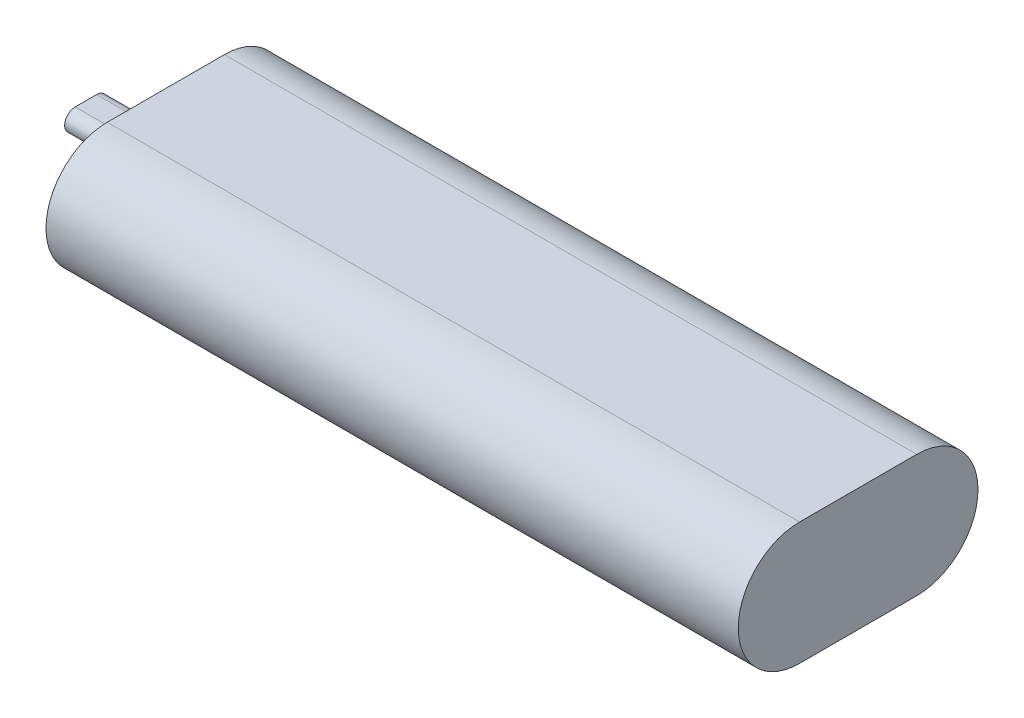
ISO-10303-21;
HEADER;
FILE_DESCRIPTION(('STEP AP214'),'2;1');
FILE_NAME('part.step','',(''),(''),'','','');
FILE_SCHEMA(('AUTOMOTIVE_DESIGN { 1 0 10303 214 1 1 1 1 }'));
ENDSEC;
DATA;
#1=APPLICATION_CONTEXT('core data for automotive mechanical design processes');
#2=APPLICATION_PROTOCOL_DEFINITION('international standard','automotive_design',2000,#1);
#3=PRODUCT_CONTEXT('',#1,'mechanical');
#4=PRODUCT('Part','Part','',(#3));
#5=PRODUCT_RELATED_PRODUCT_CATEGORY('part','',(#4));
#6=PRODUCT_DEFINITION_FORMATION('','',#4);
#7=PRODUCT_DEFINITION_CONTEXT('part definition',#1,'design');
#8=PRODUCT_DEFINITION('design','',#6,#7);
#9=PRODUCT_DEFINITION_SHAPE('','',#8);
#10=(LENGTH_UNIT() NAMED_UNIT(*) SI_UNIT(.MILLI.,.METRE.));
#11=(NAMED_UNIT(*) PLANE_ANGLE_UNIT() SI_UNIT($,.RADIAN.));
#12=(NAMED_UNIT(*) SI_UNIT($,.STERADIAN.) SOLID_ANGLE_UNIT());
#13=UNCERTAINTY_MEASURE_WITH_UNIT(LENGTH_MEASURE(1.E-05),#10,'distance_accuracy_value','');
#14=(GEOMETRIC_REPRESENTATION_CONTEXT(3) GLOBAL_UNCERTAINTY_ASSIGNED_CONTEXT((#13)) GLOBAL_UNIT_ASSIGNED_CONTEXT((#10,
#11,#12)) REPRESENTATION_CONTEXT('',''));
#15=CARTESIAN_POINT('',(0.,0.,0.));
#16=DIRECTION('',(0.,0.,1.));
#17=DIRECTION('',(1.,0.,0.));
#18=AXIS2_PLACEMENT_3D('',#15,#16,#17);
#19=CARTESIAN_POINT('',(-65.,0.,11.));
#20=DIRECTION('',(1.,0.,0.));
#21=DIRECTION('',(0.,0.,-1.));
#22=AXIS2_PLACEMENT_3D('',#19,#20,#21);
#23=PLANE('',#22);
#24=CARTESIAN_POINT('',(-65.,0.,11.));
#25=DIRECTION('',(1.,0.,0.));
#26=DIRECTION('',(0.,0.,-1.));
#27=AXIS2_PLACEMENT_3D('',#24,#25,#26);
#28=CIRCLE('',#27,11.5);
#29=CARTESIAN_POINT('',(-65.,11.5,11.));
#30=VERTEX_POINT('',#29);
#31=CARTESIAN_POINT('',(-65.,-11.5,11.));
#32=VERTEX_POINT('',#31);
#33=EDGE_CURVE('E137',#30,#32,#28,.T.);
#34=ORIENTED_EDGE('',*,*,#33,.F.);
#35=DIRECTION('',(0.,0.,1.));
#36=VECTOR('',#35,1.);
#37=CARTESIAN_POINT('',(-65.,11.5,11.));
#38=LINE('',#37,#36);
#39=CARTESIAN_POINT('',(-65.,11.5,-11.));
#40=VERTEX_POINT('',#39);
#41=EDGE_CURVE('E146',#40,#30,#38,.T.);
#42=ORIENTED_EDGE('',*,*,#41,.F.);
#43=CARTESIAN_POINT('',(-65.,0.,-11.));
#44=DIRECTION('',(1.,0.,0.));
#45=DIRECTION('',(0.,0.,-1.));
#46=AXIS2_PLACEMENT_3D('',#43,#44,#45);
#47=CIRCLE('',#46,11.5);
#48=CARTESIAN_POINT('',(-65.,-11.5,-11.));
#49=VERTEX_POINT('',#48);
#50=EDGE_CURVE('E143',#49,#40,#47,.T.);
#51=ORIENTED_EDGE('',*,*,#50,.F.);
#52=DIRECTION('',(0.,0.,-1.));
#53=VECTOR('',#52,1.);
#54=CARTESIAN_POINT('',(-65.,-11.5,11.));
#55=LINE('',#54,#53);
#56=EDGE_CURVE('E140',#32,#49,#55,.T.);
#57=ORIENTED_EDGE('',*,*,#56,.F.);
#58=EDGE_LOOP('',(#34,#42,#51,#57));
#59=FACE_BOUND('',#58,.T.);
#60=CARTESIAN_POINT('',(-65.,0.,-2.));
#61=DIRECTION('',(-1.,0.,0.));
#62=DIRECTION('',(0.,0.,1.));
#63=AXIS2_PLACEMENT_3D('',#60,#61,#62);
#64=CIRCLE('',#63,2.);
#65=CARTESIAN_POINT('',(-65.,2.,-2.));
#66=VERTEX_POINT('',#65);
#67=CARTESIAN_POINT('',(-65.,-2.,-2.));
#68=VERTEX_POINT('',#67);
#69=EDGE_CURVE('E119',#66,#68,#64,.T.);
#70=ORIENTED_EDGE('',*,*,#69,.F.);
#71=DIRECTION('',(0.,0.,-1.));
#72=VECTOR('',#71,1.);
#73=CARTESIAN_POINT('',(-65.,2.,-2.));
#74=LINE('',#73,#72);
#75=CARTESIAN_POINT('',(-65.,2.,2.));
#76=VERTEX_POINT('',#75);
#77=EDGE_CURVE('E116',#76,#66,#74,.T.);
#78=ORIENTED_EDGE('',*,*,#77,.F.);
#79=CARTESIAN_POINT('',(-65.,0.,2.));
#80=DIRECTION('',(-1.,0.,0.));
#81=DIRECTION('',(0.,0.,1.));
#82=AXIS2_PLACEMENT_3D('',#79,#80,#81);
#83=CIRCLE('',#82,2.);
#84=CARTESIAN_POINT('',(-65.,-2.,2.));
#85=VERTEX_POINT('',#84);
#86=EDGE_CURVE('E55',#85,#76,#83,.T.);
#87=ORIENTED_EDGE('',*,*,#86,.F.);
#88=DIRECTION('',(0.,0.,1.));
#89=VECTOR('',#88,1.);
#90=CARTESIAN_POINT('',(-65.,-2.,-2.));
#91=LINE('',#90,#89);
#92=EDGE_CURVE('E50',#68,#85,#91,.T.);
#93=ORIENTED_EDGE('',*,*,#92,.F.);
#94=EDGE_LOOP('',(#70,#78,#87,#93));
#95=FACE_BOUND('',#94,.T.);
#96=ADVANCED_FACE('F33',(#59,#95),#23,.F.);
#97=CARTESIAN_POINT('',(-65.,0.,11.));
#98=DIRECTION('',(1.,0.,0.));
#99=DIRECTION('',(0.,0.,-1.));
#100=AXIS2_PLACEMENT_3D('',#97,#98,#99);
#101=CYLINDRICAL_SURFACE('',#100,11.5);
#102=DIRECTION('',(1.,0.,0.));
#103=VECTOR('',#102,1.);
#104=CARTESIAN_POINT('',(-65.,-11.5,11.));
#105=LINE('',#104,#103);
#106=CARTESIAN_POINT('',(65.,-11.5,11.));
#107=VERTEX_POINT('',#106);
#108=EDGE_CURVE('E37',#32,#107,#105,.T.);
#109=ORIENTED_EDGE('',*,*,#108,.T.);
#110=CARTESIAN_POINT('',(65.,0.,11.));
#111=DIRECTION('',(1.,0.,0.));
#112=DIRECTION('',(0.,0.,-1.));
#113=AXIS2_PLACEMENT_3D('',#110,#111,#112);
#114=CIRCLE('',#113,11.5);
#115=CARTESIAN_POINT('',(65.,11.5,11.));
#116=VERTEX_POINT('',#115);
#117=EDGE_CURVE('E120',#116,#107,#114,.T.);
#118=ORIENTED_EDGE('',*,*,#117,.F.);
#119=DIRECTION('',(1.,0.,0.));
#120=VECTOR('',#119,1.);
#121=CARTESIAN_POINT('',(-65.,11.5,11.));
#122=LINE('',#121,#120);
#123=EDGE_CURVE('E11',#30,#116,#122,.T.);
#124=ORIENTED_EDGE('',*,*,#123,.F.);
#125=ORIENTED_EDGE('',*,*,#33,.T.);
#126=EDGE_LOOP('',(#109,#118,#124,#125));
#127=FACE_BOUND('',#126,.T.);
#128=ADVANCED_FACE('F35',(#127),#101,.T.);
#129=CARTESIAN_POINT('',(-65.,11.5,11.));
#130=DIRECTION('',(0.,1.,0.));
#131=DIRECTION('',(0.,0.,1.));
#132=AXIS2_PLACEMENT_3D('',#129,#130,#131);
#133=PLANE('',#132);
#134=ORIENTED_EDGE('',*,*,#123,.T.);
#135=DIRECTION('',(0.,0.,1.));
#136=VECTOR('',#135,1.);
#137=CARTESIAN_POINT('',(65.,11.5,11.));
#138=LINE('',#137,#136);
#139=CARTESIAN_POINT('',(65.,11.5,-11.));
#140=VERTEX_POINT('',#139);
#141=EDGE_CURVE('E134',#140,#116,#138,.T.);
#142=ORIENTED_EDGE('',*,*,#141,.F.);
#143=DIRECTION('',(1.,0.,0.));
#144=VECTOR('',#143,1.);
#145=CARTESIAN_POINT('',(-65.,11.5,-11.));
#146=LINE('',#145,#144);
#147=EDGE_CURVE('E42',#40,#140,#146,.T.);
#148=ORIENTED_EDGE('',*,*,#147,.F.);
#149=ORIENTED_EDGE('',*,*,#41,.T.);
#150=EDGE_LOOP('',(#134,#142,#148,#149));
#151=FACE_BOUND('',#150,.T.);
#152=ADVANCED_FACE('F162',(#151),#133,.T.);
#153=CARTESIAN_POINT('',(-65.,0.,-11.));
#154=DIRECTION('',(1.,0.,0.));
#155=DIRECTION('',(0.,0.,-1.));
#156=AXIS2_PLACEMENT_3D('',#153,#154,#155);
#157=CYLINDRICAL_SURFACE('',#156,11.5);
#158=ORIENTED_EDGE('',*,*,#147,.T.);
#159=CARTESIAN_POINT('',(65.,0.,-11.));
#160=DIRECTION('',(1.,0.,0.));
#161=DIRECTION('',(0.,0.,-1.));
#162=AXIS2_PLACEMENT_3D('',#159,#160,#161);
#163=CIRCLE('',#162,11.5);
#164=CARTESIAN_POINT('',(65.,-11.5,-11.));
#165=VERTEX_POINT('',#164);
#166=EDGE_CURVE('E131',#165,#140,#163,.T.);
#167=ORIENTED_EDGE('',*,*,#166,.F.);
#168=DIRECTION('',(1.,0.,0.));
#169=VECTOR('',#168,1.);
#170=CARTESIAN_POINT('',(-65.,-11.5,-11.));
#171=LINE('',#170,#169);
#172=EDGE_CURVE('E149',#49,#165,#171,.T.);
#173=ORIENTED_EDGE('',*,*,#172,.F.);
#174=ORIENTED_EDGE('',*,*,#50,.T.);
#175=EDGE_LOOP('',(#158,#167,#173,#174));
#176=FACE_BOUND('',#175,.T.);
#177=ADVANCED_FACE('F167',(#176),#157,.T.);
#178=CARTESIAN_POINT('',(-65.,-11.5,11.));
#179=DIRECTION('',(0.,-1.,0.));
#180=DIRECTION('',(0.,0.,-1.));
#181=AXIS2_PLACEMENT_3D('',#178,#179,#180);
#182=PLANE('',#181);
#183=ORIENTED_EDGE('',*,*,#172,.T.);
#184=DIRECTION('',(0.,0.,-1.));
#185=VECTOR('',#184,1.);
#186=CARTESIAN_POINT('',(65.,-11.5,11.));
#187=LINE('',#186,#185);
#188=EDGE_CURVE('E123',#107,#165,#187,.T.);
#189=ORIENTED_EDGE('',*,*,#188,.F.);
#190=ORIENTED_EDGE('',*,*,#108,.F.);
#191=ORIENTED_EDGE('',*,*,#56,.T.);
#192=EDGE_LOOP('',(#183,#189,#190,#191));
#193=FACE_BOUND('',#192,.T.);
#194=ADVANCED_FACE('F156',(#193),#182,.T.);
#195=CARTESIAN_POINT('',(65.,0.,11.));
#196=DIRECTION('',(1.,0.,0.));
#197=DIRECTION('',(0.,0.,-1.));
#198=AXIS2_PLACEMENT_3D('',#195,#196,#197);
#199=PLANE('',#198);
#200=ORIENTED_EDGE('',*,*,#117,.T.);
#201=ORIENTED_EDGE('',*,*,#188,.T.);
#202=ORIENTED_EDGE('',*,*,#166,.T.);
#203=ORIENTED_EDGE('',*,*,#141,.T.);
#204=EDGE_LOOP('',(#200,#201,#202,#203));
#205=FACE_BOUND('',#204,.T.);
#206=ADVANCED_FACE('F159',(#205),#199,.T.);
#207=CARTESIAN_POINT('',(-80.,0.,-2.));
#208=DIRECTION('',(1.,0.,0.));
#209=DIRECTION('',(0.,0.,-1.));
#210=AXIS2_PLACEMENT_3D('',#207,#208,#209);
#211=CYLINDRICAL_SURFACE('',#210,2.);
#212=ORIENTED_EDGE('',*,*,#69,.T.);
#213=DIRECTION('',(1.,0.,0.));
#214=VECTOR('',#213,1.);
#215=CARTESIAN_POINT('',(-80.,-2.,-2.));
#216=LINE('',#215,#214);
#217=CARTESIAN_POINT('',(-80.,-2.,-2.));
#218=VERTEX_POINT('',#217);
#219=EDGE_CURVE('E100',#218,#68,#216,.T.);
#220=ORIENTED_EDGE('',*,*,#219,.F.);
#221=CARTESIAN_POINT('',(-80.,0.,-2.));
#222=DIRECTION('',(-1.,0.,0.));
#223=DIRECTION('',(0.,0.,1.));
#224=AXIS2_PLACEMENT_3D('',#221,#222,#223);
#225=CIRCLE('',#224,2.);
#226=CARTESIAN_POINT('',(-80.,2.,-2.));
#227=VERTEX_POINT('',#226);
#228=EDGE_CURVE('E107',#227,#218,#225,.T.);
#229=ORIENTED_EDGE('',*,*,#228,.F.);
#230=DIRECTION('',(1.,0.,0.));
#231=VECTOR('',#230,1.);
#232=CARTESIAN_POINT('',(-80.,2.,-2.));
#233=LINE('',#232,#231);
#234=EDGE_CURVE('E260',#227,#66,#233,.T.);
#235=ORIENTED_EDGE('',*,*,#234,.T.);
#236=EDGE_LOOP('',(#212,#220,#229,#235));
#237=FACE_BOUND('',#236,.T.);
#238=ADVANCED_FACE('F118',(#237),#211,.T.);
#239=CARTESIAN_POINT('',(-80.,-2.,-2.));
#240=DIRECTION('',(0.,1.,0.));
#241=DIRECTION('',(0.,0.,1.));
#242=AXIS2_PLACEMENT_3D('',#239,#240,#241);
#243=PLANE('',#242);
#244=ORIENTED_EDGE('',*,*,#92,.T.);
#245=DIRECTION('',(1.,0.,0.));
#246=VECTOR('',#245,1.);
#247=CARTESIAN_POINT('',(-80.,-2.,2.));
#248=LINE('',#247,#246);
#249=CARTESIAN_POINT('',(-80.,-2.,2.));
#250=VERTEX_POINT('',#249);
#251=EDGE_CURVE('E103',#250,#85,#248,.T.);
#252=ORIENTED_EDGE('',*,*,#251,.F.);
#253=DIRECTION('',(0.,0.,1.));
#254=VECTOR('',#253,1.);
#255=CARTESIAN_POINT('',(-80.,-2.,-2.));
#256=LINE('',#255,#254);
#257=EDGE_CURVE('E96',#218,#250,#256,.T.);
#258=ORIENTED_EDGE('',*,*,#257,.F.);
#259=ORIENTED_EDGE('',*,*,#219,.T.);
#260=EDGE_LOOP('',(#244,#252,#258,#259));
#261=FACE_BOUND('',#260,.T.);
#262=ADVANCED_FACE('F98',(#261),#243,.F.);
#263=CARTESIAN_POINT('',(-80.,0.,2.));
#264=DIRECTION('',(1.,0.,0.));
#265=DIRECTION('',(0.,0.,-1.));
#266=AXIS2_PLACEMENT_3D('',#263,#264,#265);
#267=CYLINDRICAL_SURFACE('',#266,2.);
#268=ORIENTED_EDGE('',*,*,#86,.T.);
#269=DIRECTION('',(1.,0.,0.));
#270=VECTOR('',#269,1.);
#271=CARTESIAN_POINT('',(-80.,2.,2.));
#272=LINE('',#271,#270);
#273=CARTESIAN_POINT('',(-80.,2.,2.));
#274=VERTEX_POINT('',#273);
#275=EDGE_CURVE('E125',#274,#76,#272,.T.);
#276=ORIENTED_EDGE('',*,*,#275,.F.);
#277=CARTESIAN_POINT('',(-80.,0.,2.));
#278=DIRECTION('',(-1.,0.,0.));
#279=DIRECTION('',(0.,0.,1.));
#280=AXIS2_PLACEMENT_3D('',#277,#278,#279);
#281=CIRCLE('',#280,2.);
#282=EDGE_CURVE('E106',#250,#274,#281,.T.);
#283=ORIENTED_EDGE('',*,*,#282,.F.);
#284=ORIENTED_EDGE('',*,*,#251,.T.);
#285=EDGE_LOOP('',(#268,#276,#283,#284));
#286=FACE_BOUND('',#285,.T.);
#287=ADVANCED_FACE('F189',(#286),#267,.T.);
#288=CARTESIAN_POINT('',(-80.,2.,-2.));
#289=DIRECTION('',(0.,-1.,0.));
#290=DIRECTION('',(0.,0.,-1.));
#291=AXIS2_PLACEMENT_3D('',#288,#289,#290);
#292=PLANE('',#291);
#293=ORIENTED_EDGE('',*,*,#77,.T.);
#294=ORIENTED_EDGE('',*,*,#234,.F.);
#295=DIRECTION('',(0.,0.,-1.));
#296=VECTOR('',#295,1.);
#297=CARTESIAN_POINT('',(-80.,2.,-2.));
#298=LINE('',#297,#296);
#299=EDGE_CURVE('E112',#274,#227,#298,.T.);
#300=ORIENTED_EDGE('',*,*,#299,.F.);
#301=ORIENTED_EDGE('',*,*,#275,.T.);
#302=EDGE_LOOP('',(#293,#294,#300,#301));
#303=FACE_BOUND('',#302,.T.);
#304=ADVANCED_FACE('F192',(#303),#292,.F.);
#305=CARTESIAN_POINT('',(-80.,0.,-2.));
#306=DIRECTION('',(-1.,0.,0.));
#307=DIRECTION('',(0.,0.,1.));
#308=AXIS2_PLACEMENT_3D('',#305,#306,#307);
#309=PLANE('',#308);
#310=ORIENTED_EDGE('',*,*,#228,.T.);
#311=ORIENTED_EDGE('',*,*,#257,.T.);
#312=ORIENTED_EDGE('',*,*,#282,.T.);
#313=ORIENTED_EDGE('',*,*,#299,.T.);
#314=EDGE_LOOP('',(#310,#311,#312,#313));
#315=FACE_BOUND('',#314,.T.);
#316=ADVANCED_FACE('F110',(#315),#309,.T.);
#317=CLOSED_SHELL('',(#96,#128,#152,#177,#194,#206,#238,#262,#287,#304,#316));
#318=MANIFOLD_SOLID_BREP('B2',#317);
#319=ADVANCED_BREP_SHAPE_REPRESENTATION('',(#18,#318),#14);
#320=SHAPE_DEFINITION_REPRESENTATION(#9,#319);
ENDSEC;
END-ISO-10303-21;
